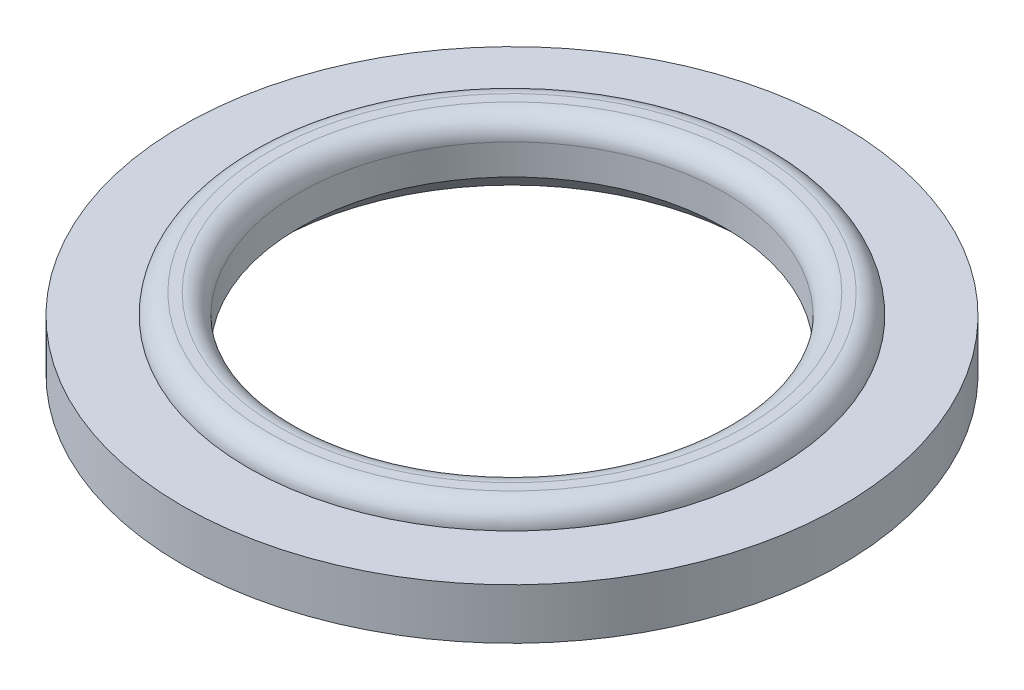
ISO-10303-21;
HEADER;
FILE_DESCRIPTION(('STEP AP214'),'2;1');
FILE_NAME('part.step','',(''),(''),'','','');
FILE_SCHEMA(('AUTOMOTIVE_DESIGN { 1 0 10303 214 1 1 1 1 }'));
ENDSEC;
DATA;
#1=APPLICATION_CONTEXT('core data for automotive mechanical design processes');
#2=APPLICATION_PROTOCOL_DEFINITION('international standard','automotive_design',2000,#1);
#3=PRODUCT_CONTEXT('',#1,'mechanical');
#4=PRODUCT('Part','Part','',(#3));
#5=PRODUCT_RELATED_PRODUCT_CATEGORY('part','',(#4));
#6=PRODUCT_DEFINITION_FORMATION('','',#4);
#7=PRODUCT_DEFINITION_CONTEXT('part definition',#1,'design');
#8=PRODUCT_DEFINITION('design','',#6,#7);
#9=PRODUCT_DEFINITION_SHAPE('','',#8);
#10=(LENGTH_UNIT() NAMED_UNIT(*) SI_UNIT(.MILLI.,.METRE.));
#11=(NAMED_UNIT(*) PLANE_ANGLE_UNIT() SI_UNIT($,.RADIAN.));
#12=(NAMED_UNIT(*) SI_UNIT($,.STERADIAN.) SOLID_ANGLE_UNIT());
#13=UNCERTAINTY_MEASURE_WITH_UNIT(LENGTH_MEASURE(1.E-05),#10,'distance_accuracy_value','');
#14=(GEOMETRIC_REPRESENTATION_CONTEXT(3) GLOBAL_UNCERTAINTY_ASSIGNED_CONTEXT((#13)) GLOBAL_UNIT_ASSIGNED_CONTEXT((#10,
#11,#12)) REPRESENTATION_CONTEXT('',''));
#15=CARTESIAN_POINT('',(0.,0.,0.));
#16=DIRECTION('',(0.,0.,1.));
#17=DIRECTION('',(1.,0.,0.));
#18=AXIS2_PLACEMENT_3D('',#15,#16,#17);
#19=CARTESIAN_POINT('',(-26.0591825482289,-6.5,0.));
#20=DIRECTION('',(0.,1.,0.));
#21=DIRECTION('',(0.,0.,1.));
#22=AXIS2_PLACEMENT_3D('',#19,#20,#21);
#23=PLANE('',#22);
#24=CARTESIAN_POINT('',(0.,-6.5,0.));
#25=DIRECTION('',(0.,-1.,0.));
#26=DIRECTION('',(0.,0.,-1.));
#27=AXIS2_PLACEMENT_3D('',#24,#25,#26);
#28=CIRCLE('',#27,26.0591825482289);
#29=CARTESIAN_POINT('',(0.,-6.5,-26.0591825482289));
#30=VERTEX_POINT('',#29);
#31=EDGE_CURVE('E164',#30,#30,#28,.F.);
#32=ORIENTED_EDGE('',*,*,#31,.F.);
#33=EDGE_LOOP('',(#32));
#34=FACE_BOUND('',#33,.T.);
#35=CARTESIAN_POINT('',(0.,-6.5,0.));
#36=DIRECTION('',(0.,-1.,0.));
#37=DIRECTION('',(1.,0.,0.));
#38=AXIS2_PLACEMENT_3D('',#35,#36,#37);
#39=CIRCLE('',#38,23.5591825482289);
#40=CARTESIAN_POINT('',(23.5591825482289,-6.5,0.));
#41=VERTEX_POINT('',#40);
#42=EDGE_CURVE('E162',#41,#41,#39,.F.);
#43=ORIENTED_EDGE('',*,*,#42,.T.);
#44=EDGE_LOOP('',(#43));
#45=FACE_BOUND('',#44,.T.);
#46=ADVANCED_FACE('F18',(#34,#45),#23,.F.);
#47=CARTESIAN_POINT('',(0.,0.,0.));
#48=DIRECTION('',(0.,-1.,0.));
#49=DIRECTION('',(0.,0.,-1.));
#50=AXIS2_PLACEMENT_3D('',#47,#48,#49);
#51=CYLINDRICAL_SURFACE('',#50,26.0591825482289);
#52=ORIENTED_EDGE('',*,*,#31,.T.);
#53=EDGE_LOOP('',(#52));
#54=FACE_BOUND('',#53,.T.);
#55=CARTESIAN_POINT('',(0.,-3.5,0.));
#56=DIRECTION('',(0.,-1.,0.));
#57=DIRECTION('',(0.,0.,-1.));
#58=AXIS2_PLACEMENT_3D('',#55,#56,#57);
#59=CIRCLE('',#58,26.0591825482289);
#60=CARTESIAN_POINT('',(0.,-3.5,-26.0591825482289));
#61=VERTEX_POINT('',#60);
#62=EDGE_CURVE('E150',#61,#61,#59,.T.);
#63=ORIENTED_EDGE('',*,*,#62,.T.);
#64=EDGE_LOOP('',(#63));
#65=FACE_BOUND('',#64,.T.);
#66=ADVANCED_FACE('F168',(#54,#65),#51,.T.);
#67=CARTESIAN_POINT('',(0.,-6.5,0.));
#68=DIRECTION('',(0.,-1.,0.));
#69=DIRECTION('',(1.,0.,0.));
#70=AXIS2_PLACEMENT_3D('',#67,#68,#69);
#71=CONICAL_SURFACE('',#70,23.5591825482289,0.797095675453747);
#72=CARTESIAN_POINT('',(0.,-4.,0.));
#73=DIRECTION('',(0.,-1.,0.));
#74=DIRECTION('',(0.,0.,-1.));
#75=AXIS2_PLACEMENT_3D('',#72,#73,#74);
#76=CIRCLE('',#75,21.);
#77=CARTESIAN_POINT('',(0.,-4.,-21.));
#78=VERTEX_POINT('',#77);
#79=EDGE_CURVE('E148',#78,#78,#76,.F.);
#80=ORIENTED_EDGE('',*,*,#79,.T.);
#81=EDGE_LOOP('',(#80));
#82=FACE_BOUND('',#81,.T.);
#83=ORIENTED_EDGE('',*,*,#42,.F.);
#84=EDGE_LOOP('',(#83));
#85=FACE_BOUND('',#84,.T.);
#86=ADVANCED_FACE('F175',(#82,#85),#71,.F.);
#87=CARTESIAN_POINT('',(-29.5591825482289,-3.5,0.));
#88=DIRECTION('',(0.,1.,0.));
#89=DIRECTION('',(0.,0.,1.));
#90=AXIS2_PLACEMENT_3D('',#87,#88,#89);
#91=PLANE('',#90);
#92=CARTESIAN_POINT('',(0.,-3.5,0.));
#93=DIRECTION('',(0.,-1.,0.));
#94=DIRECTION('',(1.,0.,0.));
#95=AXIS2_PLACEMENT_3D('',#92,#93,#94);
#96=CIRCLE('',#95,29.5591825482289);
#97=CARTESIAN_POINT('',(29.5591825482289,-3.5,0.));
#98=VERTEX_POINT('',#97);
#99=EDGE_CURVE('E147',#98,#98,#96,.T.);
#100=ORIENTED_EDGE('',*,*,#99,.T.);
#101=EDGE_LOOP('',(#100));
#102=FACE_BOUND('',#101,.T.);
#103=ORIENTED_EDGE('',*,*,#62,.F.);
#104=EDGE_LOOP('',(#103));
#105=FACE_BOUND('',#104,.T.);
#106=ADVANCED_FACE('F177',(#102,#105),#91,.F.);
#107=CARTESIAN_POINT('',(0.,0.,0.));
#108=DIRECTION('',(0.,-1.,0.));
#109=DIRECTION('',(0.,0.,-1.));
#110=AXIS2_PLACEMENT_3D('',#107,#108,#109);
#111=CYLINDRICAL_SURFACE('',#110,21.);
#112=CARTESIAN_POINT('',(0.,-1.,0.));
#113=DIRECTION('',(0.,-1.,0.));
#114=DIRECTION('',(0.,0.,-1.));
#115=AXIS2_PLACEMENT_3D('',#112,#113,#114);
#116=CIRCLE('',#115,21.);
#117=CARTESIAN_POINT('',(0.,-1.,-21.));
#118=VERTEX_POINT('',#117);
#119=EDGE_CURVE('E139',#118,#118,#116,.T.);
#120=ORIENTED_EDGE('',*,*,#119,.F.);
#121=EDGE_LOOP('',(#120));
#122=FACE_BOUND('',#121,.T.);
#123=ORIENTED_EDGE('',*,*,#79,.F.);
#124=EDGE_LOOP('',(#123));
#125=FACE_BOUND('',#124,.T.);
#126=ADVANCED_FACE('F185',(#122,#125),#111,.F.);
#127=CARTESIAN_POINT('',(0.,-6.,0.));
#128=DIRECTION('',(0.,-1.,0.));
#129=DIRECTION('',(1.,0.,0.));
#130=AXIS2_PLACEMENT_3D('',#127,#128,#129);
#131=CONICAL_SURFACE('',#130,30.,0.174532925199429);
#132=ORIENTED_EDGE('',*,*,#99,.F.);
#133=EDGE_LOOP('',(#132));
#134=FACE_BOUND('',#133,.T.);
#135=CARTESIAN_POINT('',(0.,-6.00000000000001,0.));
#136=DIRECTION('',(0.,-1.,0.));
#137=DIRECTION('',(1.,0.,0.));
#138=AXIS2_PLACEMENT_3D('',#135,#136,#137);
#139=CIRCLE('',#138,30.);
#140=CARTESIAN_POINT('',(30.,-6.,0.));
#141=VERTEX_POINT('',#140);
#142=EDGE_CURVE('E59',#141,#141,#139,.T.);
#143=ORIENTED_EDGE('',*,*,#142,.T.);
#144=EDGE_LOOP('',(#143));
#145=FACE_BOUND('',#144,.T.);
#146=ADVANCED_FACE('F133',(#134,#145),#131,.F.);
#147=CARTESIAN_POINT('',(0.,-1.,0.));
#148=DIRECTION('',(0.,-1.,0.));
#149=DIRECTION('',(0.,0.,-1.));
#150=AXIS2_PLACEMENT_3D('',#147,#148,#149);
#151=TOROIDAL_SURFACE('',#150,23.,2.);
#152=CARTESIAN_POINT('',(0.,1.,0.));
#153=DIRECTION('',(0.,1.,0.));
#154=DIRECTION('',(0.,0.,-1.));
#155=AXIS2_PLACEMENT_3D('',#152,#153,#154);
#156=CIRCLE('',#155,23.);
#157=CARTESIAN_POINT('',(0.,1.,-23.));
#158=VERTEX_POINT('',#157);
#159=CARTESIAN_POINT('',(0.,1.,23.));
#160=VERTEX_POINT('',#159);
#161=EDGE_CURVE('E46',#158,#160,#156,.T.);
#162=ORIENTED_EDGE('',*,*,#161,.T.);
#163=CARTESIAN_POINT('',(0.,1.,0.));
#164=DIRECTION('',(0.,1.,0.));
#165=DIRECTION('',(0.,0.,1.));
#166=AXIS2_PLACEMENT_3D('',#163,#164,#165);
#167=CIRCLE('',#166,23.);
#168=EDGE_CURVE('E49',#160,#158,#167,.T.);
#169=ORIENTED_EDGE('',*,*,#168,.T.);
#170=EDGE_LOOP('',(#162,#169));
#171=FACE_BOUND('',#170,.T.);
#172=ORIENTED_EDGE('',*,*,#119,.T.);
#173=EDGE_LOOP('',(#172));
#174=FACE_BOUND('',#173,.T.);
#175=ADVANCED_FACE('F57',(#171,#174),#151,.T.);
#176=CARTESIAN_POINT('',(-32.5,-6.,0.));
#177=DIRECTION('',(0.,1.,0.));
#178=DIRECTION('',(0.,0.,1.));
#179=AXIS2_PLACEMENT_3D('',#176,#177,#178);
#180=PLANE('',#179);
#181=CARTESIAN_POINT('',(0.,-6.,0.));
#182=DIRECTION('',(0.,-1.,0.));
#183=DIRECTION('',(0.,0.,-1.));
#184=AXIS2_PLACEMENT_3D('',#181,#182,#183);
#185=CIRCLE('',#184,32.5);
#186=CARTESIAN_POINT('',(0.,-6.,-32.5));
#187=VERTEX_POINT('',#186);
#188=EDGE_CURVE('E54',#187,#187,#185,.F.);
#189=ORIENTED_EDGE('',*,*,#188,.F.);
#190=EDGE_LOOP('',(#189));
#191=FACE_BOUND('',#190,.T.);
#192=ORIENTED_EDGE('',*,*,#142,.F.);
#193=EDGE_LOOP('',(#192));
#194=FACE_BOUND('',#193,.T.);
#195=ADVANCED_FACE('F94',(#191,#194),#180,.F.);
#196=CARTESIAN_POINT('',(-21.,1.,0.));
#197=DIRECTION('',(0.,-1.,0.));
#198=DIRECTION('',(0.,0.,-1.));
#199=AXIS2_PLACEMENT_3D('',#196,#197,#198);
#200=PLANE('',#199);
#201=CARTESIAN_POINT('',(0.,1.,0.));
#202=DIRECTION('',(0.,-1.,0.));
#203=DIRECTION('',(0.,0.,-1.));
#204=AXIS2_PLACEMENT_3D('',#201,#202,#203);
#205=CIRCLE('',#204,24.);
#206=CARTESIAN_POINT('',(0.,1.,-24.));
#207=VERTEX_POINT('',#206);
#208=CARTESIAN_POINT('',(0.,1.,24.));
#209=VERTEX_POINT('',#208);
#210=EDGE_CURVE('E37',#207,#209,#205,.T.);
#211=ORIENTED_EDGE('',*,*,#210,.F.);
#212=CARTESIAN_POINT('',(0.,1.,0.));
#213=DIRECTION('',(0.,-1.,0.));
#214=DIRECTION('',(0.,0.,1.));
#215=AXIS2_PLACEMENT_3D('',#212,#213,#214);
#216=CIRCLE('',#215,24.);
#217=EDGE_CURVE('E112',#209,#207,#216,.T.);
#218=ORIENTED_EDGE('',*,*,#217,.F.);
#219=EDGE_LOOP('',(#211,#218));
#220=FACE_BOUND('',#219,.T.);
#221=ORIENTED_EDGE('',*,*,#161,.F.);
#222=ORIENTED_EDGE('',*,*,#168,.F.);
#223=EDGE_LOOP('',(#221,#222));
#224=FACE_BOUND('',#223,.T.);
#225=ADVANCED_FACE('F51',(#220,#224),#200,.F.);
#226=CARTESIAN_POINT('',(0.,0.,0.));
#227=DIRECTION('',(0.,-1.,0.));
#228=DIRECTION('',(0.,0.,-1.));
#229=AXIS2_PLACEMENT_3D('',#226,#227,#228);
#230=CYLINDRICAL_SURFACE('',#229,32.5);
#231=ORIENTED_EDGE('',*,*,#188,.T.);
#232=EDGE_LOOP('',(#231));
#233=FACE_BOUND('',#232,.T.);
#234=CARTESIAN_POINT('',(0.,-1.,0.));
#235=DIRECTION('',(0.,-1.,0.));
#236=DIRECTION('',(0.,0.,-1.));
#237=AXIS2_PLACEMENT_3D('',#234,#235,#236);
#238=CIRCLE('',#237,32.5);
#239=CARTESIAN_POINT('',(0.,-1.,-32.5));
#240=VERTEX_POINT('',#239);
#241=EDGE_CURVE('E29',#240,#240,#238,.T.);
#242=ORIENTED_EDGE('',*,*,#241,.T.);
#243=EDGE_LOOP('',(#242));
#244=FACE_BOUND('',#243,.T.);
#245=ADVANCED_FACE('F78',(#233,#244),#230,.T.);
#246=CARTESIAN_POINT('',(0.,-1.,0.));
#247=DIRECTION('',(0.,-1.,0.));
#248=DIRECTION('',(0.,0.,-1.));
#249=AXIS2_PLACEMENT_3D('',#246,#247,#248);
#250=TOROIDAL_SURFACE('',#249,24.,2.);
#251=CARTESIAN_POINT('',(0.,-1.,0.));
#252=DIRECTION('',(0.,-1.,0.));
#253=DIRECTION('',(0.,0.,-1.));
#254=AXIS2_PLACEMENT_3D('',#251,#252,#253);
#255=CIRCLE('',#254,26.);
#256=CARTESIAN_POINT('',(0.,-1.,-26.));
#257=VERTEX_POINT('',#256);
#258=EDGE_CURVE('E11',#257,#257,#255,.F.);
#259=ORIENTED_EDGE('',*,*,#258,.T.);
#260=EDGE_LOOP('',(#259));
#261=FACE_BOUND('',#260,.T.);
#262=ORIENTED_EDGE('',*,*,#210,.T.);
#263=ORIENTED_EDGE('',*,*,#217,.T.);
#264=EDGE_LOOP('',(#262,#263));
#265=FACE_BOUND('',#264,.T.);
#266=ADVANCED_FACE('F66',(#261,#265),#250,.T.);
#267=CARTESIAN_POINT('',(-26.,-1.,0.));
#268=DIRECTION('',(0.,-1.,0.));
#269=DIRECTION('',(0.,0.,-1.));
#270=AXIS2_PLACEMENT_3D('',#267,#268,#269);
#271=PLANE('',#270);
#272=ORIENTED_EDGE('',*,*,#258,.F.);
#273=EDGE_LOOP('',(#272));
#274=FACE_BOUND('',#273,.T.);
#275=ORIENTED_EDGE('',*,*,#241,.F.);
#276=EDGE_LOOP('',(#275));
#277=FACE_BOUND('',#276,.T.);
#278=ADVANCED_FACE('F77',(#274,#277),#271,.F.);
#279=CLOSED_SHELL('',(#46,#66,#86,#106,#126,#146,#175,#195,#225,#245,#266,#278));
#280=MANIFOLD_SOLID_BREP('B1',#279);
#281=ADVANCED_BREP_SHAPE_REPRESENTATION('',(#18,#280),#14);
#282=SHAPE_DEFINITION_REPRESENTATION(#9,#281);
ENDSEC;
END-ISO-10303-21;
